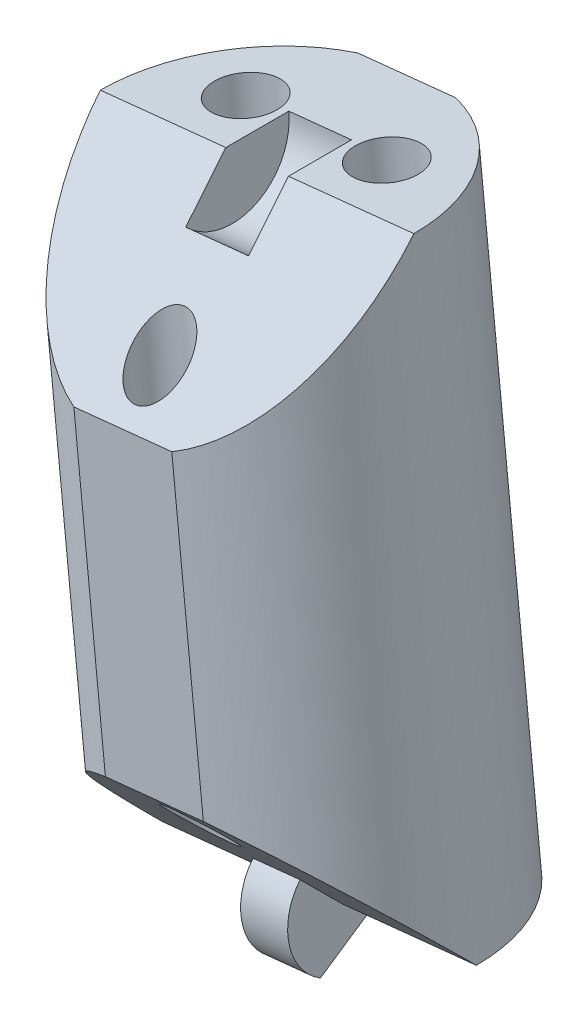
ISO-10303-21;
HEADER;
FILE_DESCRIPTION(('STEP AP214'),'2;1');
FILE_NAME('part.step','',(''),(''),'','','');
FILE_SCHEMA(('AUTOMOTIVE_DESIGN { 1 0 10303 214 1 1 1 1 }'));
ENDSEC;
DATA;
#1=APPLICATION_CONTEXT('core data for automotive mechanical design processes');
#2=APPLICATION_PROTOCOL_DEFINITION('international standard','automotive_design',2000,#1);
#3=PRODUCT_CONTEXT('',#1,'mechanical');
#4=PRODUCT('Part','Part','',(#3));
#5=PRODUCT_RELATED_PRODUCT_CATEGORY('part','',(#4));
#6=PRODUCT_DEFINITION_FORMATION('','',#4);
#7=PRODUCT_DEFINITION_CONTEXT('part definition',#1,'design');
#8=PRODUCT_DEFINITION('design','',#6,#7);
#9=PRODUCT_DEFINITION_SHAPE('','',#8);
#10=(LENGTH_UNIT() NAMED_UNIT(*) SI_UNIT(.MILLI.,.METRE.));
#11=(NAMED_UNIT(*) PLANE_ANGLE_UNIT() SI_UNIT($,.RADIAN.));
#12=(NAMED_UNIT(*) SI_UNIT($,.STERADIAN.) SOLID_ANGLE_UNIT());
#13=UNCERTAINTY_MEASURE_WITH_UNIT(LENGTH_MEASURE(1.E-05),#10,'distance_accuracy_value','');
#14=(GEOMETRIC_REPRESENTATION_CONTEXT(3) GLOBAL_UNCERTAINTY_ASSIGNED_CONTEXT((#13)) GLOBAL_UNIT_ASSIGNED_CONTEXT((#10,
#11,#12)) REPRESENTATION_CONTEXT('',''));
#15=CARTESIAN_POINT('',(0.,0.,0.));
#16=DIRECTION('',(0.,0.,1.));
#17=DIRECTION('',(1.,0.,0.));
#18=AXIS2_PLACEMENT_3D('',#15,#16,#17);
#19=CARTESIAN_POINT('',(-6.79829307780345,166.682960173583,0.));
#20=DIRECTION('',(-0.103150523023817,0.994665757729657,0.));
#21=DIRECTION('',(-0.994665757729657,-0.103150523023817,0.));
#22=AXIS2_PLACEMENT_3D('',#19,#20,#21);
#23=CYLINDRICAL_SURFACE('',#22,8.);
#24=CARTESIAN_POINT('',(-6.79829307780345,166.682960173583,0.));
#25=DIRECTION('',(0.103150523023817,-0.994665757729657,0.));
#26=DIRECTION('',(0.994665757729657,0.103150523023817,0.));
#27=AXIS2_PLACEMENT_3D('',#24,#25,#26);
#28=CIRCLE('',#27,8.);
#29=CARTESIAN_POINT('',(-4.31361881136458,166.94063009751,-7.6));
#30=VERTEX_POINT('',#29);
#31=CARTESIAN_POINT('',(1.15903298403381,167.508164357773,0.));
#32=VERTEX_POINT('',#31);
#33=EDGE_CURVE('E156',#30,#32,#28,.T.);
#34=ORIENTED_EDGE('',*,*,#33,.F.);
#35=DIRECTION('',(-0.103150523023817,0.994665757729657,0.));
#36=VECTOR('',#35,1.);
#37=CARTESIAN_POINT('',(-4.31361881136459,166.94063009751,-7.6));
#38=LINE('',#37,#36);
#39=CARTESIAN_POINT('',(-7.48403157112503,197.512467423771,-7.6));
#40=VERTEX_POINT('',#39);
#41=EDGE_CURVE('E11',#30,#40,#38,.T.);
#42=ORIENTED_EDGE('',*,*,#41,.T.);
#43=CARTESIAN_POINT('',(-9.9687058375639,197.254797499844,0.));
#44=DIRECTION('',(0.103150523023817,-0.994665757729657,0.));
#45=DIRECTION('',(0.994665757729657,0.103150523023817,0.));
#46=AXIS2_PLACEMENT_3D('',#43,#44,#45);
#47=CIRCLE('',#46,8.);
#48=CARTESIAN_POINT('',(-2.01137977572664,198.080001684034,0.));
#49=VERTEX_POINT('',#48);
#50=EDGE_CURVE('E148',#40,#49,#47,.T.);
#51=ORIENTED_EDGE('',*,*,#50,.T.);
#52=CARTESIAN_POINT('',(-9.9687058375639,197.254797499844,0.));
#53=DIRECTION('',(0.0729384343130803,-0.703334902304701,-0.707106781186543));
#54=DIRECTION('',(-0.0729384343130795,0.703334902304692,-0.707106781186552));
#55=AXIS2_PLACEMENT_3D('',#52,#53,#54);
#56=ELLIPSE('',#55,11.3137084989847,8.);
#57=CARTESIAN_POINT('',(-6.70008759614404,189.953007665026,7.6));
#58=VERTEX_POINT('',#57);
#59=EDGE_CURVE('E202',#49,#58,#56,.T.);
#60=ORIENTED_EDGE('',*,*,#59,.T.);
#61=DIRECTION('',(-0.103150523023817,0.994665757729657,0.));
#62=VECTOR('',#61,1.);
#63=CARTESIAN_POINT('',(-4.31361881136459,166.94063009751,7.6));
#64=LINE('',#63,#62);
#65=CARTESIAN_POINT('',(-5.09756278634559,174.500089856255,7.6));
#66=VERTEX_POINT('',#65);
#67=EDGE_CURVE('E174',#58,#66,#64,.F.);
#68=ORIENTED_EDGE('',*,*,#67,.T.);
#69=CARTESIAN_POINT('',(-6.79829307780345,166.682960173583,0.));
#70=DIRECTION('',(-0.0729384343130802,0.703334902304699,-0.707106781186544));
#71=DIRECTION('',(-0.0729384343130796,0.703334902304693,0.707106781186551));
#72=AXIS2_PLACEMENT_3D('',#69,#70,#71);
#73=ELLIPSE('',#72,11.3137084989847,8.);
#74=EDGE_CURVE('E207',#66,#32,#73,.T.);
#75=ORIENTED_EDGE('',*,*,#74,.T.);
#76=EDGE_LOOP('',(#34,#42,#51,#60,#68,#75));
#77=FACE_BOUND('',#76,.T.);
#78=ADVANCED_FACE('F39',(#77),#23,.T.);
#79=CARTESIAN_POINT('',(-9.9687058375639,197.254797499844,0.));
#80=DIRECTION('',(0.103150523023817,-0.994665757729657,0.));
#81=DIRECTION('',(0.994665757729657,0.103150523023817,0.));
#82=AXIS2_PLACEMENT_3D('',#79,#80,#81);
#83=PLANE('',#82);
#84=CARTESIAN_POINT('',(-13.5495025653907,196.883455616958,-3.));
#85=DIRECTION('',(0.103150523023817,-0.994665757729657,0.));
#86=DIRECTION('',(0.994665757729657,0.103150523023817,0.));
#87=AXIS2_PLACEMENT_3D('',#84,#85,#86);
#88=CIRCLE('',#87,1.6);
#89=CARTESIAN_POINT('',(-11.9580373530232,197.048496453796,-3.));
#90=VERTEX_POINT('',#89);
#91=EDGE_CURVE('E189',#90,#90,#88,.T.);
#92=ORIENTED_EDGE('',*,*,#91,.T.);
#93=EDGE_LOOP('',(#92));
#94=FACE_BOUND('',#93,.T.);
#95=CARTESIAN_POINT('',(-6.38790910973713,197.62613938273,-3.));
#96=DIRECTION('',(0.103150523023817,-0.994665757729657,0.));
#97=DIRECTION('',(0.994665757729657,0.103150523023817,0.));
#98=AXIS2_PLACEMENT_3D('',#95,#96,#97);
#99=CIRCLE('',#98,1.6);
#100=CARTESIAN_POINT('',(-4.79644389736968,197.791180219568,-3.));
#101=VERTEX_POINT('',#100);
#102=EDGE_CURVE('E184',#101,#101,#99,.T.);
#103=ORIENTED_EDGE('',*,*,#102,.T.);
#104=EDGE_LOOP('',(#103));
#105=FACE_BOUND('',#104,.T.);
#106=ORIENTED_EDGE('',*,*,#50,.F.);
#107=DIRECTION('',(0.994665757729657,0.103150523023816,0.));
#108=VECTOR('',#107,1.);
#109=CARTESIAN_POINT('',(-12.4533801040028,196.997127575917,-7.6));
#110=LINE('',#109,#108);
#111=CARTESIAN_POINT('',(-12.4533801040028,196.997127575917,-7.6));
#112=VERTEX_POINT('',#111);
#113=EDGE_CURVE('E134',#112,#40,#110,.T.);
#114=ORIENTED_EDGE('',*,*,#113,.F.);
#115=CARTESIAN_POINT('',(-17.9260318994012,196.429593315653,0.));
#116=VERTEX_POINT('',#115);
#117=EDGE_CURVE('E146',#116,#112,#47,.T.);
#118=ORIENTED_EDGE('',*,*,#117,.F.);
#119=DIRECTION('',(0.994665757729657,0.103150523023817,0.));
#120=VECTOR('',#119,1.);
#121=CARTESIAN_POINT('',(-9.9687058375639,197.254797499844,0.));
#122=LINE('',#121,#120);
#123=CARTESIAN_POINT('',(-11.5601710499314,197.089756663006,0.));
#124=VERTEX_POINT('',#123);
#125=EDGE_CURVE('E165',#116,#124,#122,.T.);
#126=ORIENTED_EDGE('',*,*,#125,.T.);
#127=DIRECTION('',(0.,0.,-1.));
#128=VECTOR('',#127,1.);
#129=CARTESIAN_POINT('',(-11.5601710499314,197.089756663006,0.));
#130=LINE('',#129,#128);
#131=CARTESIAN_POINT('',(-11.5601710499314,197.089756663006,-3.2));
#132=VERTEX_POINT('',#131);
#133=EDGE_CURVE('E256',#124,#132,#130,.T.);
#134=ORIENTED_EDGE('',*,*,#133,.T.);
#135=DIRECTION('',(-0.994665757729657,-0.103150523023817,0.));
#136=VECTOR('',#135,1.);
#137=CARTESIAN_POINT('',(-8.37724062519646,197.419838336682,-3.2));
#138=LINE('',#137,#136);
#139=CARTESIAN_POINT('',(-8.37724062519646,197.419838336682,-3.2));
#140=VERTEX_POINT('',#139);
#141=EDGE_CURVE('E269',#140,#132,#138,.T.);
#142=ORIENTED_EDGE('',*,*,#141,.F.);
#143=DIRECTION('',(0.,0.,-1.));
#144=VECTOR('',#143,1.);
#145=CARTESIAN_POINT('',(-8.37724062519647,197.419838336682,0.));
#146=LINE('',#145,#144);
#147=CARTESIAN_POINT('',(-8.37724062519647,197.419838336682,0.));
#148=VERTEX_POINT('',#147);
#149=EDGE_CURVE('E257',#148,#140,#146,.T.);
#150=ORIENTED_EDGE('',*,*,#149,.F.);
#151=EDGE_CURVE('E169',#148,#49,#122,.T.);
#152=ORIENTED_EDGE('',*,*,#151,.T.);
#153=EDGE_LOOP('',(#106,#114,#118,#126,#134,#142,#150,#152));
#154=FACE_BOUND('',#153,.T.);
#155=ADVANCED_FACE('F144',(#94,#105,#154),#83,.F.);
#156=CARTESIAN_POINT('',(1.12529969588913,198.405286962572,0.));
#157=DIRECTION('',(0.0729384343130803,-0.703334902304701,-0.707106781186543));
#158=DIRECTION('',(0.,0.708995228875744,-0.705213276556412));
#159=AXIS2_PLACEMENT_3D('',#156,#157,#158);
#160=PLANE('',#159);
#161=CARTESIAN_POINT('',(-9.40137796093292,191.784135832331,5.5));
#162=DIRECTION('',(0.0729384343130803,-0.703334902304701,-0.707106781186543));
#163=DIRECTION('',(-0.0729384343130795,0.703334902304692,-0.707106781186552));
#164=AXIS2_PLACEMENT_3D('',#161,#162,#163);
#165=ELLIPSE('',#164,1.97989898732232,1.4);
#166=CARTESIAN_POINT('',(-9.54578869316626,193.176667893152,4.1));
#167=VERTEX_POINT('',#166);
#168=EDGE_CURVE('E179',#167,#167,#165,.T.);
#169=ORIENTED_EDGE('',*,*,#168,.T.);
#170=EDGE_LOOP('',(#169));
#171=FACE_BOUND('',#170,.T.);
#172=CARTESIAN_POINT('',(-11.6694361290218,189.437667817172,7.6));
#173=VERTEX_POINT('',#172);
#174=EDGE_CURVE('E153',#173,#116,#56,.T.);
#175=ORIENTED_EDGE('',*,*,#174,.F.);
#176=DIRECTION('',(0.994665757729657,0.103150523023817,0.));
#177=VECTOR('',#176,1.);
#178=CARTESIAN_POINT('',(1.90924367087013,190.845827203827,7.6));
#179=LINE('',#178,#177);
#180=EDGE_CURVE('E198',#173,#58,#179,.T.);
#181=ORIENTED_EDGE('',*,*,#180,.T.);
#182=ORIENTED_EDGE('',*,*,#59,.F.);
#183=ORIENTED_EDGE('',*,*,#151,.F.);
#184=DIRECTION('',(-0.0729384343130776,0.703334902304677,-0.707106781186567));
#185=VECTOR('',#184,1.);
#186=CARTESIAN_POINT('',(-8.14383763539462,195.169166649307,2.26274169979702));
#187=LINE('',#186,#185);
#188=CARTESIAN_POINT('',(-8.14383763539462,195.169166649307,2.26274169979702));
#189=VERTEX_POINT('',#188);
#190=EDGE_CURVE('E266',#189,#148,#187,.T.);
#191=ORIENTED_EDGE('',*,*,#190,.F.);
#192=DIRECTION('',(-0.994665757729657,-0.103150523023817,0.));
#193=VECTOR('',#192,1.);
#194=CARTESIAN_POINT('',(-8.14383763539462,195.169166649307,2.26274169979702));
#195=LINE('',#194,#193);
#196=CARTESIAN_POINT('',(-11.3267680601295,194.839084975631,2.26274169979702));
#197=VERTEX_POINT('',#196);
#198=EDGE_CURVE('E278',#189,#197,#195,.T.);
#199=ORIENTED_EDGE('',*,*,#198,.T.);
#200=DIRECTION('',(-0.0729384343130776,0.703334902304677,-0.707106781186567));
#201=VECTOR('',#200,1.);
#202=CARTESIAN_POINT('',(-11.3267680601295,194.839084975631,2.26274169979702));
#203=LINE('',#202,#201);
#204=EDGE_CURVE('E262',#197,#124,#203,.T.);
#205=ORIENTED_EDGE('',*,*,#204,.T.);
#206=ORIENTED_EDGE('',*,*,#125,.F.);
#207=EDGE_LOOP('',(#175,#181,#182,#183,#191,#199,#205,#206));
#208=FACE_BOUND('',#207,.T.);
#209=ADVANCED_FACE('F196',(#171,#208),#160,.F.);
#210=CARTESIAN_POINT('',(-6.79829307780345,166.682960173583,0.));
#211=DIRECTION('',(0.103150523023817,-0.994665757729657,0.));
#212=DIRECTION('',(0.994665757729657,0.103150523023817,0.));
#213=AXIS2_PLACEMENT_3D('',#210,#211,#212);
#214=PLANE('',#213);
#215=DIRECTION('',(-0.994665757729657,-0.103150523023817,0.));
#216=VECTOR('',#215,1.);
#217=CARTESIAN_POINT('',(-6.79829307780345,166.682960173583,-7.6));
#218=LINE('',#217,#216);
#219=CARTESIAN_POINT('',(-9.28296734424231,166.425290249656,-7.6));
#220=VERTEX_POINT('',#219);
#221=EDGE_CURVE('E55',#30,#220,#218,.T.);
#222=ORIENTED_EDGE('',*,*,#221,.F.);
#223=ORIENTED_EDGE('',*,*,#33,.T.);
#224=DIRECTION('',(0.994665757729657,0.103150523023817,0.));
#225=VECTOR('',#224,1.);
#226=CARTESIAN_POINT('',(-6.79829307780345,166.682960173583,0.));
#227=LINE('',#226,#225);
#228=CARTESIAN_POINT('',(-5.60469416852787,166.806740801211,0.));
#229=VERTEX_POINT('',#228);
#230=EDGE_CURVE('E168',#229,#32,#227,.T.);
#231=ORIENTED_EDGE('',*,*,#230,.F.);
#232=DIRECTION('',(0.,0.,-1.));
#233=VECTOR('',#232,1.);
#234=CARTESIAN_POINT('',(-5.60469416852788,166.806740801211,0.));
#235=LINE('',#234,#233);
#236=CARTESIAN_POINT('',(-5.60469416852788,166.806740801211,-2.8));
#237=VERTEX_POINT('',#236);
#238=EDGE_CURVE('E282',#229,#237,#235,.T.);
#239=ORIENTED_EDGE('',*,*,#238,.T.);
#240=DIRECTION('',(0.994665757729657,0.103150523023817,0.));
#241=VECTOR('',#240,1.);
#242=CARTESIAN_POINT('',(-7.99189198707905,166.559179545954,-2.8));
#243=LINE('',#242,#241);
#244=CARTESIAN_POINT('',(-7.99189198707905,166.559179545954,-2.8));
#245=VERTEX_POINT('',#244);
#246=EDGE_CURVE('E203',#245,#237,#243,.T.);
#247=ORIENTED_EDGE('',*,*,#246,.F.);
#248=DIRECTION('',(0.,0.,-1.));
#249=VECTOR('',#248,1.);
#250=CARTESIAN_POINT('',(-7.99189198707905,166.559179545954,0.));
#251=LINE('',#250,#249);
#252=CARTESIAN_POINT('',(-7.99189198707905,166.559179545954,0.));
#253=VERTEX_POINT('',#252);
#254=EDGE_CURVE('E237',#253,#245,#251,.T.);
#255=ORIENTED_EDGE('',*,*,#254,.F.);
#256=CARTESIAN_POINT('',(-14.7556191396407,165.857755989392,0.));
#257=VERTEX_POINT('',#256);
#258=EDGE_CURVE('E170',#257,#253,#227,.T.);
#259=ORIENTED_EDGE('',*,*,#258,.F.);
#260=EDGE_CURVE('E160',#257,#220,#28,.T.);
#261=ORIENTED_EDGE('',*,*,#260,.T.);
#262=EDGE_LOOP('',(#222,#223,#231,#239,#247,#255,#259,#261));
#263=FACE_BOUND('',#262,.T.);
#264=CARTESIAN_POINT('',(-10.3790898056302,166.311618290697,-3.));
#265=DIRECTION('',(0.103150523023817,-0.994665757729657,0.));
#266=DIRECTION('',(0.994665757729657,0.103150523023817,0.));
#267=AXIS2_PLACEMENT_3D('',#264,#265,#266);
#268=CIRCLE('',#267,1.6);
#269=CARTESIAN_POINT('',(-8.78762459326276,166.476659127535,-3.));
#270=VERTEX_POINT('',#269);
#271=EDGE_CURVE('E185',#270,#270,#268,.T.);
#272=ORIENTED_EDGE('',*,*,#271,.F.);
#273=EDGE_LOOP('',(#272));
#274=FACE_BOUND('',#273,.T.);
#275=CARTESIAN_POINT('',(-3.21749634997668,167.054302056468,-3.));
#276=DIRECTION('',(0.103150523023817,-0.994665757729657,0.));
#277=DIRECTION('',(0.994665757729657,0.103150523023817,0.));
#278=AXIS2_PLACEMENT_3D('',#275,#276,#277);
#279=CIRCLE('',#278,1.6);
#280=CARTESIAN_POINT('',(-1.62603113760923,167.219342893306,-3.));
#281=VERTEX_POINT('',#280);
#282=EDGE_CURVE('E180',#281,#281,#279,.T.);
#283=ORIENTED_EDGE('',*,*,#282,.F.);
#284=EDGE_LOOP('',(#283));
#285=FACE_BOUND('',#284,.T.);
#286=ADVANCED_FACE('F232',(#263,#274,#285),#214,.T.);
#287=CARTESIAN_POINT('',(4.29571245564958,167.833449636311,0.));
#288=DIRECTION('',(-0.0729384343130802,0.703334902304699,-0.707106781186544));
#289=DIRECTION('',(0.,0.708995228875745,0.705213276556411));
#290=AXIS2_PLACEMENT_3D('',#287,#288,#289);
#291=PLANE('',#290);
#292=CARTESIAN_POINT('',(-7.36562095443444,172.153621841096,5.5));
#293=DIRECTION('',(-0.0729384343130802,0.703334902304699,-0.707106781186544));
#294=DIRECTION('',(-0.0729384343130796,0.703334902304693,0.707106781186551));
#295=AXIS2_PLACEMENT_3D('',#292,#293,#294);
#296=ELLIPSE('',#295,1.97989898732232,1.4);
#297=CARTESIAN_POINT('',(-7.51003168666778,173.546153901917,6.9));
#298=VERTEX_POINT('',#297);
#299=EDGE_CURVE('E175',#298,#298,#296,.T.);
#300=ORIENTED_EDGE('',*,*,#299,.T.);
#301=EDGE_LOOP('',(#300));
#302=FACE_BOUND('',#301,.T.);
#303=ORIENTED_EDGE('',*,*,#74,.F.);
#304=DIRECTION('',(-0.994665757729657,-0.103150523023817,0.));
#305=VECTOR('',#304,1.);
#306=CARTESIAN_POINT('',(3.51176848066858,175.392909395056,7.6));
#307=LINE('',#306,#305);
#308=CARTESIAN_POINT('',(-10.0669113192233,173.984750008401,7.6));
#309=VERTEX_POINT('',#308);
#310=EDGE_CURVE('E63',#66,#309,#307,.T.);
#311=ORIENTED_EDGE('',*,*,#310,.T.);
#312=EDGE_CURVE('E162',#257,#309,#73,.T.);
#313=ORIENTED_EDGE('',*,*,#312,.F.);
#314=ORIENTED_EDGE('',*,*,#258,.T.);
#315=DIRECTION('',(0.0729384343130816,-0.703334902304711,-0.707106781186533));
#316=VECTOR('',#315,1.);
#317=CARTESIAN_POINT('',(-8.19611960315568,168.528517272407,1.97989898732229));
#318=LINE('',#317,#316);
#319=CARTESIAN_POINT('',(-8.19611960315568,168.528517272407,1.97989898732229));
#320=VERTEX_POINT('',#319);
#321=EDGE_CURVE('E239',#320,#253,#318,.T.);
#322=ORIENTED_EDGE('',*,*,#321,.F.);
#323=DIRECTION('',(0.994665757729657,0.103150523023817,0.));
#324=VECTOR('',#323,1.);
#325=CARTESIAN_POINT('',(-8.19611960315568,168.528517272407,1.97989898732229));
#326=LINE('',#325,#324);
#327=CARTESIAN_POINT('',(-5.8089217846045,168.776078527664,1.97989898732229));
#328=VERTEX_POINT('',#327);
#329=EDGE_CURVE('E295',#320,#328,#326,.T.);
#330=ORIENTED_EDGE('',*,*,#329,.T.);
#331=DIRECTION('',(0.0729384343130816,-0.703334902304711,-0.707106781186533));
#332=VECTOR('',#331,1.);
#333=CARTESIAN_POINT('',(-5.8089217846045,168.776078527664,1.97989898732229));
#334=LINE('',#333,#332);
#335=EDGE_CURVE('E225',#328,#229,#334,.T.);
#336=ORIENTED_EDGE('',*,*,#335,.T.);
#337=ORIENTED_EDGE('',*,*,#230,.T.);
#338=EDGE_LOOP('',(#303,#311,#313,#314,#322,#330,#336,#337));
#339=FACE_BOUND('',#338,.T.);
#340=ADVANCED_FACE('F222',(#302,#339),#291,.F.);
#341=ORIENTED_EDGE('',*,*,#117,.T.);
#342=DIRECTION('',(-0.103150523023817,0.994665757729657,0.));
#343=VECTOR('',#342,1.);
#344=CARTESIAN_POINT('',(-9.28296734424231,166.425290249656,-7.6));
#345=LINE('',#344,#343);
#346=EDGE_CURVE('E48',#112,#220,#345,.F.);
#347=ORIENTED_EDGE('',*,*,#346,.T.);
#348=ORIENTED_EDGE('',*,*,#260,.F.);
#349=ORIENTED_EDGE('',*,*,#312,.T.);
#350=DIRECTION('',(-0.103150523023817,0.994665757729657,0.));
#351=VECTOR('',#350,1.);
#352=CARTESIAN_POINT('',(-9.28296734424231,166.425290249656,7.6));
#353=LINE('',#352,#351);
#354=EDGE_CURVE('E140',#309,#173,#353,.T.);
#355=ORIENTED_EDGE('',*,*,#354,.T.);
#356=ORIENTED_EDGE('',*,*,#174,.T.);
#357=EDGE_LOOP('',(#341,#347,#348,#349,#355,#356));
#358=FACE_BOUND('',#357,.T.);
#359=ADVANCED_FACE('F41',(#358),#23,.T.);
#360=CARTESIAN_POINT('',(-7.99189198707905,166.559179545954,-2.8));
#361=DIRECTION('',(-0.0893309733522768,0.86140581446838,0.500000000000002));
#362=DIRECTION('',(0.,-0.502007025803865,0.864863541862852));
#363=AXIS2_PLACEMENT_3D('',#360,#361,#362);
#364=PLANE('',#363);
#365=DIRECTION('',(0.0515752615119084,-0.49733287886483,0.866025403784438));
#366=VECTOR('',#365,1.);
#367=CARTESIAN_POINT('',(-5.60469416852788,166.806740801211,-2.8));
#368=LINE('',#367,#366);
#369=CARTESIAN_POINT('',(-5.3545674431415,164.3948045207,1.4));
#370=VERTEX_POINT('',#369);
#371=EDGE_CURVE('E298',#237,#370,#368,.T.);
#372=ORIENTED_EDGE('',*,*,#371,.T.);
#373=DIRECTION('',(0.994665757729657,0.103150523023817,0.));
#374=VECTOR('',#373,1.);
#375=CARTESIAN_POINT('',(-7.74176526169268,164.147243265443,1.4));
#376=LINE('',#375,#374);
#377=CARTESIAN_POINT('',(-7.74176526169268,164.147243265443,1.4));
#378=VERTEX_POINT('',#377);
#379=EDGE_CURVE('E209',#378,#370,#376,.T.);
#380=ORIENTED_EDGE('',*,*,#379,.F.);
#381=DIRECTION('',(0.0515752615119084,-0.49733287886483,0.866025403784438));
#382=VECTOR('',#381,1.);
#383=CARTESIAN_POINT('',(-7.99189198707905,166.559179545954,-2.8));
#384=LINE('',#383,#382);
#385=EDGE_CURVE('E287',#245,#378,#384,.T.);
#386=ORIENTED_EDGE('',*,*,#385,.F.);
#387=ORIENTED_EDGE('',*,*,#246,.T.);
#388=EDGE_LOOP('',(#372,#380,#386,#387));
#389=FACE_BOUND('',#388,.T.);
#390=ADVANCED_FACE('F318',(#389),#364,.F.);
#391=CARTESIAN_POINT('',(-7.99189198707905,166.559179545954,0.));
#392=DIRECTION('',(0.994665757729657,0.103150523023817,0.));
#393=DIRECTION('',(-0.103150523023817,0.994665757729657,0.));
#394=AXIS2_PLACEMENT_3D('',#391,#392,#393);
#395=CYLINDRICAL_SURFACE('',#394,2.80000000000001);
#396=CARTESIAN_POINT('',(-5.60469416852788,166.806740801211,0.));
#397=DIRECTION('',(-0.994665757729657,-0.103150523023817,0.));
#398=DIRECTION('',(-0.103150523023817,0.994665757729657,0.));
#399=AXIS2_PLACEMENT_3D('',#396,#397,#398);
#400=CIRCLE('',#399,2.80000000000001);
#401=EDGE_CURVE('E301',#370,#328,#400,.T.);
#402=ORIENTED_EDGE('',*,*,#401,.T.);
#403=ORIENTED_EDGE('',*,*,#329,.F.);
#404=CARTESIAN_POINT('',(-7.99189198707905,166.559179545954,0.));
#405=DIRECTION('',(-0.994665757729657,-0.103150523023817,0.));
#406=DIRECTION('',(-0.103150523023817,0.994665757729657,0.));
#407=AXIS2_PLACEMENT_3D('',#404,#405,#406);
#408=CIRCLE('',#407,2.80000000000001);
#409=EDGE_CURVE('E290',#378,#320,#408,.T.);
#410=ORIENTED_EDGE('',*,*,#409,.F.);
#411=ORIENTED_EDGE('',*,*,#379,.T.);
#412=EDGE_LOOP('',(#402,#403,#410,#411));
#413=FACE_BOUND('',#412,.T.);
#414=ADVANCED_FACE('F313',(#413),#395,.T.);
#415=CARTESIAN_POINT('',(-7.99189198707905,166.559179545954,0.));
#416=DIRECTION('',(0.994665757729657,0.103150523023817,0.));
#417=DIRECTION('',(-0.103150523023817,0.994665757729657,0.));
#418=AXIS2_PLACEMENT_3D('',#415,#416,#417);
#419=PLANE('',#418);
#420=ORIENTED_EDGE('',*,*,#254,.T.);
#421=ORIENTED_EDGE('',*,*,#385,.T.);
#422=ORIENTED_EDGE('',*,*,#409,.T.);
#423=ORIENTED_EDGE('',*,*,#321,.T.);
#424=EDGE_LOOP('',(#420,#421,#422,#423));
#425=FACE_BOUND('',#424,.T.);
#426=ADVANCED_FACE('F320',(#425),#419,.F.);
#427=CARTESIAN_POINT('',(-5.60469416852788,166.806740801211,0.));
#428=DIRECTION('',(0.994665757729657,0.103150523023817,0.));
#429=DIRECTION('',(-0.103150523023817,0.994665757729657,0.));
#430=AXIS2_PLACEMENT_3D('',#427,#428,#429);
#431=PLANE('',#430);
#432=ORIENTED_EDGE('',*,*,#238,.F.);
#433=ORIENTED_EDGE('',*,*,#335,.F.);
#434=ORIENTED_EDGE('',*,*,#401,.F.);
#435=ORIENTED_EDGE('',*,*,#371,.F.);
#436=EDGE_LOOP('',(#432,#433,#434,#435));
#437=FACE_BOUND('',#436,.T.);
#438=ADVANCED_FACE('F317',(#437),#431,.T.);
#439=CARTESIAN_POINT('',(-8.37724062519647,197.419838336682,0.));
#440=DIRECTION('',(-0.994665757729657,-0.103150523023817,0.));
#441=DIRECTION('',(0.103150523023817,-0.994665757729657,0.));
#442=AXIS2_PLACEMENT_3D('',#439,#440,#441);
#443=CYLINDRICAL_SURFACE('',#442,3.2);
#444=CARTESIAN_POINT('',(-11.5601710499314,197.089756663006,0.));
#445=DIRECTION('',(-0.994665757729657,-0.103150523023817,0.));
#446=DIRECTION('',(0.103150523023817,-0.994665757729657,0.));
#447=AXIS2_PLACEMENT_3D('',#444,#445,#446);
#448=CIRCLE('',#447,3.2);
#449=EDGE_CURVE('E273',#132,#197,#448,.T.);
#450=ORIENTED_EDGE('',*,*,#449,.T.);
#451=ORIENTED_EDGE('',*,*,#198,.F.);
#452=CARTESIAN_POINT('',(-8.37724062519647,197.419838336682,0.));
#453=DIRECTION('',(-0.994665757729657,-0.103150523023817,0.));
#454=DIRECTION('',(0.103150523023817,-0.994665757729657,0.));
#455=AXIS2_PLACEMENT_3D('',#452,#453,#454);
#456=CIRCLE('',#455,3.2);
#457=EDGE_CURVE('E261',#140,#189,#456,.T.);
#458=ORIENTED_EDGE('',*,*,#457,.F.);
#459=ORIENTED_EDGE('',*,*,#141,.T.);
#460=EDGE_LOOP('',(#450,#451,#458,#459));
#461=FACE_BOUND('',#460,.T.);
#462=ADVANCED_FACE('F327',(#461),#443,.F.);
#463=CARTESIAN_POINT('',(-8.37724062519647,197.419838336682,0.));
#464=DIRECTION('',(-0.994665757729657,-0.103150523023817,0.));
#465=DIRECTION('',(0.103150523023817,-0.994665757729657,0.));
#466=AXIS2_PLACEMENT_3D('',#463,#464,#465);
#467=PLANE('',#466);
#468=ORIENTED_EDGE('',*,*,#149,.T.);
#469=ORIENTED_EDGE('',*,*,#457,.T.);
#470=ORIENTED_EDGE('',*,*,#190,.T.);
#471=EDGE_LOOP('',(#468,#469,#470));
#472=FACE_BOUND('',#471,.T.);
#473=ADVANCED_FACE('F368',(#472),#467,.T.);
#474=CARTESIAN_POINT('',(-11.5601710499314,197.089756663006,0.));
#475=DIRECTION('',(-0.994665757729657,-0.103150523023817,0.));
#476=DIRECTION('',(0.103150523023817,-0.994665757729657,0.));
#477=AXIS2_PLACEMENT_3D('',#474,#475,#476);
#478=PLANE('',#477);
#479=ORIENTED_EDGE('',*,*,#133,.F.);
#480=ORIENTED_EDGE('',*,*,#204,.F.);
#481=ORIENTED_EDGE('',*,*,#449,.F.);
#482=EDGE_LOOP('',(#479,#480,#481));
#483=FACE_BOUND('',#482,.T.);
#484=ADVANCED_FACE('F358',(#483),#478,.F.);
#485=CARTESIAN_POINT('',(-6.4534615884975,163.357799383847,5.5));
#486=DIRECTION('',(-0.103150523023817,0.994665757729657,0.));
#487=DIRECTION('',(-0.994665757729657,-0.103150523023817,0.));
#488=AXIS2_PLACEMENT_3D('',#485,#486,#487);
#489=CYLINDRICAL_SURFACE('',#488,1.4);
#490=ORIENTED_EDGE('',*,*,#299,.F.);
#491=EDGE_LOOP('',(#490));
#492=FACE_BOUND('',#491,.T.);
#493=ORIENTED_EDGE('',*,*,#168,.F.);
#494=EDGE_LOOP('',(#493));
#495=FACE_BOUND('',#494,.T.);
#496=ADVANCED_FACE('F355',(#492,#495),#489,.F.);
#497=CARTESIAN_POINT('',(-2.87266486067074,163.729141266732,-3.));
#498=DIRECTION('',(-0.103150523023817,0.994665757729657,0.));
#499=DIRECTION('',(-0.994665757729657,-0.103150523023817,0.));
#500=AXIS2_PLACEMENT_3D('',#497,#498,#499);
#501=CYLINDRICAL_SURFACE('',#500,1.6);
#502=ORIENTED_EDGE('',*,*,#282,.T.);
#503=EDGE_LOOP('',(#502));
#504=FACE_BOUND('',#503,.T.);
#505=ORIENTED_EDGE('',*,*,#102,.F.);
#506=EDGE_LOOP('',(#505));
#507=FACE_BOUND('',#506,.T.);
#508=ADVANCED_FACE('F357',(#504,#507),#501,.F.);
#509=CARTESIAN_POINT('',(-10.0342583163243,162.986457500961,-3.));
#510=DIRECTION('',(-0.103150523023817,0.994665757729657,0.));
#511=DIRECTION('',(-0.994665757729657,-0.103150523023817,0.));
#512=AXIS2_PLACEMENT_3D('',#509,#510,#511);
#513=CYLINDRICAL_SURFACE('',#512,1.6);
#514=ORIENTED_EDGE('',*,*,#271,.T.);
#515=EDGE_LOOP('',(#514));
#516=FACE_BOUND('',#515,.T.);
#517=ORIENTED_EDGE('',*,*,#91,.F.);
#518=EDGE_LOOP('',(#517));
#519=FACE_BOUND('',#518,.T.);
#520=ADVANCED_FACE('F365',(#516,#519),#513,.F.);
#521=CARTESIAN_POINT('',(-8.93813585493637,163.10012945992,7.6));
#522=DIRECTION('',(0.,0.,-1.));
#523=DIRECTION('',(-1.,0.,0.));
#524=AXIS2_PLACEMENT_3D('',#521,#522,#523);
#525=PLANE('',#524);
#526=ORIENTED_EDGE('',*,*,#354,.F.);
#527=ORIENTED_EDGE('',*,*,#310,.F.);
#528=ORIENTED_EDGE('',*,*,#67,.F.);
#529=ORIENTED_EDGE('',*,*,#180,.F.);
#530=EDGE_LOOP('',(#526,#527,#528,#529));
#531=FACE_BOUND('',#530,.T.);
#532=ADVANCED_FACE('F374',(#531),#525,.F.);
#533=CARTESIAN_POINT('',(-8.93813585493637,163.10012945992,-7.6));
#534=DIRECTION('',(0.,0.,1.));
#535=DIRECTION('',(1.,0.,0.));
#536=AXIS2_PLACEMENT_3D('',#533,#534,#535);
#537=PLANE('',#536);
#538=ORIENTED_EDGE('',*,*,#221,.T.);
#539=ORIENTED_EDGE('',*,*,#346,.F.);
#540=ORIENTED_EDGE('',*,*,#113,.T.);
#541=ORIENTED_EDGE('',*,*,#41,.F.);
#542=EDGE_LOOP('',(#538,#539,#540,#541));
#543=FACE_BOUND('',#542,.T.);
#544=ADVANCED_FACE('F133',(#543),#537,.F.);
#545=CLOSED_SHELL('',(#78,#155,#209,#286,#340,#359,#390,#414,#426,#438,#462,#473,#484,#496,#508,
#520,#532,#544));
#546=MANIFOLD_SOLID_BREP('B2',#545);
#547=ADVANCED_BREP_SHAPE_REPRESENTATION('',(#18,#546),#14);
#548=SHAPE_DEFINITION_REPRESENTATION(#9,#547);
ENDSEC;
END-ISO-10303-21;
